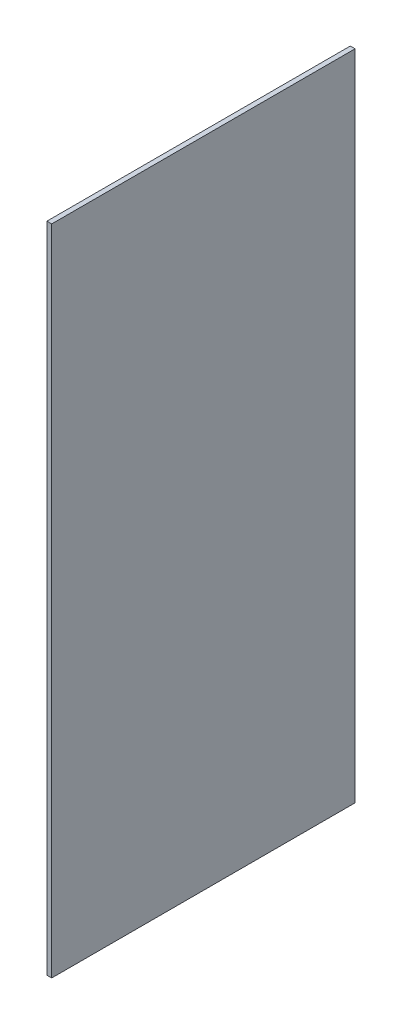
ISO-10303-21;
HEADER;
FILE_DESCRIPTION(('STEP AP214'),'2;1');
FILE_NAME('part.step','',(''),(''),'','','');
FILE_SCHEMA(('AUTOMOTIVE_DESIGN { 1 0 10303 214 1 1 1 1 }'));
ENDSEC;
DATA;
#1=APPLICATION_CONTEXT('core data for automotive mechanical design processes');
#2=APPLICATION_PROTOCOL_DEFINITION('international standard','automotive_design',2000,#1);
#3=PRODUCT_CONTEXT('',#1,'mechanical');
#4=PRODUCT('Part','Part','',(#3));
#5=PRODUCT_RELATED_PRODUCT_CATEGORY('part','',(#4));
#6=PRODUCT_DEFINITION_FORMATION('','',#4);
#7=PRODUCT_DEFINITION_CONTEXT('part definition',#1,'design');
#8=PRODUCT_DEFINITION('design','',#6,#7);
#9=PRODUCT_DEFINITION_SHAPE('','',#8);
#10=(LENGTH_UNIT() NAMED_UNIT(*) SI_UNIT(.MILLI.,.METRE.));
#11=(NAMED_UNIT(*) PLANE_ANGLE_UNIT() SI_UNIT($,.RADIAN.));
#12=(NAMED_UNIT(*) SI_UNIT($,.STERADIAN.) SOLID_ANGLE_UNIT());
#13=UNCERTAINTY_MEASURE_WITH_UNIT(LENGTH_MEASURE(1.E-05),#10,'distance_accuracy_value','');
#14=(GEOMETRIC_REPRESENTATION_CONTEXT(3) GLOBAL_UNCERTAINTY_ASSIGNED_CONTEXT((#13)) GLOBAL_UNIT_ASSIGNED_CONTEXT((#10,
#11,#12)) REPRESENTATION_CONTEXT('',''));
#15=CARTESIAN_POINT('',(0.,0.,0.));
#16=DIRECTION('',(0.,0.,1.));
#17=DIRECTION('',(1.,0.,0.));
#18=AXIS2_PLACEMENT_3D('',#15,#16,#17);
#19=CARTESIAN_POINT('',(-260.5,0.,-599.011002297004));
#20=DIRECTION('',(1.,0.,0.));
#21=DIRECTION('',(0.,0.,-1.));
#22=AXIS2_PLACEMENT_3D('',#19,#20,#21);
#23=PLANE('',#22);
#24=DIRECTION('',(0.,0.,1.));
#25=VECTOR('',#24,1.);
#26=CARTESIAN_POINT('',(-260.5,0.,-599.011002297004));
#27=LINE('',#26,#25);
#28=CARTESIAN_POINT('',(-260.5,0.,-190.));
#29=VERTEX_POINT('',#28);
#30=CARTESIAN_POINT('',(-260.5,0.,0.));
#31=VERTEX_POINT('',#30);
#32=EDGE_CURVE('E11',#29,#31,#27,.T.);
#33=ORIENTED_EDGE('',*,*,#32,.F.);
#34=DIRECTION('',(0.,1.,0.));
#35=VECTOR('',#34,1.);
#36=CARTESIAN_POINT('',(-260.5,0.,-190.));
#37=LINE('',#36,#35);
#38=CARTESIAN_POINT('',(-260.5,409.,-190.));
#39=VERTEX_POINT('',#38);
#40=EDGE_CURVE('E78',#29,#39,#37,.T.);
#41=ORIENTED_EDGE('',*,*,#40,.T.);
#42=DIRECTION('',(0.,0.,1.));
#43=VECTOR('',#42,1.);
#44=CARTESIAN_POINT('',(-260.5,409.,-599.011002297004));
#45=LINE('',#44,#43);
#46=CARTESIAN_POINT('',(-260.5,409.,0.));
#47=VERTEX_POINT('',#46);
#48=EDGE_CURVE('E39',#39,#47,#45,.T.);
#49=ORIENTED_EDGE('',*,*,#48,.T.);
#50=DIRECTION('',(0.,1.,0.));
#51=VECTOR('',#50,1.);
#52=CARTESIAN_POINT('',(-260.5,0.,0.));
#53=LINE('',#52,#51);
#54=EDGE_CURVE('E99',#31,#47,#53,.T.);
#55=ORIENTED_EDGE('',*,*,#54,.F.);
#56=EDGE_LOOP('',(#33,#41,#49,#55));
#57=FACE_BOUND('',#56,.T.);
#58=ADVANCED_FACE('F36',(#57),#23,.T.);
#59=CARTESIAN_POINT('',(-260.5,0.,-599.011002297004));
#60=DIRECTION('',(0.,1.,0.));
#61=DIRECTION('',(0.,0.,1.));
#62=AXIS2_PLACEMENT_3D('',#59,#60,#61);
#63=PLANE('',#62);
#64=DIRECTION('',(1.,0.,0.));
#65=VECTOR('',#64,1.);
#66=CARTESIAN_POINT('',(-260.5,0.,-190.));
#67=LINE('',#66,#65);
#68=CARTESIAN_POINT('',(-263.5,0.,-190.));
#69=VERTEX_POINT('',#68);
#70=EDGE_CURVE('E75',#29,#69,#67,.F.);
#71=ORIENTED_EDGE('',*,*,#70,.F.);
#72=ORIENTED_EDGE('',*,*,#32,.T.);
#73=DIRECTION('',(-1.,0.,0.));
#74=VECTOR('',#73,1.);
#75=CARTESIAN_POINT('',(-260.5,0.,0.));
#76=LINE('',#75,#74);
#77=CARTESIAN_POINT('',(-263.5,0.,0.));
#78=VERTEX_POINT('',#77);
#79=EDGE_CURVE('E89',#31,#78,#76,.T.);
#80=ORIENTED_EDGE('',*,*,#79,.T.);
#81=DIRECTION('',(0.,0.,1.));
#82=VECTOR('',#81,1.);
#83=CARTESIAN_POINT('',(-263.5,0.,-599.011002297004));
#84=LINE('',#83,#82);
#85=EDGE_CURVE('E44',#69,#78,#84,.T.);
#86=ORIENTED_EDGE('',*,*,#85,.F.);
#87=EDGE_LOOP('',(#71,#72,#80,#86));
#88=FACE_BOUND('',#87,.T.);
#89=ADVANCED_FACE('F88',(#88),#63,.F.);
#90=CARTESIAN_POINT('',(-263.5,0.,-599.011002297004));
#91=DIRECTION('',(1.,0.,0.));
#92=DIRECTION('',(0.,0.,-1.));
#93=AXIS2_PLACEMENT_3D('',#90,#91,#92);
#94=PLANE('',#93);
#95=DIRECTION('',(0.,1.,0.));
#96=VECTOR('',#95,1.);
#97=CARTESIAN_POINT('',(-263.5,0.,-190.));
#98=LINE('',#97,#96);
#99=CARTESIAN_POINT('',(-263.5,409.,-190.));
#100=VERTEX_POINT('',#99);
#101=EDGE_CURVE('E52',#69,#100,#98,.T.);
#102=ORIENTED_EDGE('',*,*,#101,.F.);
#103=ORIENTED_EDGE('',*,*,#85,.T.);
#104=DIRECTION('',(0.,1.,0.));
#105=VECTOR('',#104,1.);
#106=CARTESIAN_POINT('',(-263.5,0.,0.));
#107=LINE('',#106,#105);
#108=CARTESIAN_POINT('',(-263.5,409.,0.));
#109=VERTEX_POINT('',#108);
#110=EDGE_CURVE('E94',#78,#109,#107,.T.);
#111=ORIENTED_EDGE('',*,*,#110,.T.);
#112=DIRECTION('',(0.,0.,1.));
#113=VECTOR('',#112,1.);
#114=CARTESIAN_POINT('',(-263.5,409.,-599.011002297004));
#115=LINE('',#114,#113);
#116=EDGE_CURVE('E86',#100,#109,#115,.T.);
#117=ORIENTED_EDGE('',*,*,#116,.F.);
#118=EDGE_LOOP('',(#102,#103,#111,#117));
#119=FACE_BOUND('',#118,.T.);
#120=ADVANCED_FACE('F84',(#119),#94,.F.);
#121=CARTESIAN_POINT('',(-263.5,409.,-599.011002297004));
#122=DIRECTION('',(0.,-1.,0.));
#123=DIRECTION('',(0.,0.,-1.));
#124=AXIS2_PLACEMENT_3D('',#121,#122,#123);
#125=PLANE('',#124);
#126=DIRECTION('',(1.,0.,0.));
#127=VECTOR('',#126,1.);
#128=CARTESIAN_POINT('',(-260.5,409.,-190.));
#129=LINE('',#128,#127);
#130=EDGE_CURVE('E80',#39,#100,#129,.F.);
#131=ORIENTED_EDGE('',*,*,#130,.T.);
#132=ORIENTED_EDGE('',*,*,#116,.T.);
#133=DIRECTION('',(1.,0.,0.));
#134=VECTOR('',#133,1.);
#135=CARTESIAN_POINT('',(-263.5,409.,0.));
#136=LINE('',#135,#134);
#137=EDGE_CURVE('E96',#109,#47,#136,.T.);
#138=ORIENTED_EDGE('',*,*,#137,.T.);
#139=ORIENTED_EDGE('',*,*,#48,.F.);
#140=EDGE_LOOP('',(#131,#132,#138,#139));
#141=FACE_BOUND('',#140,.T.);
#142=ADVANCED_FACE('F107',(#141),#125,.F.);
#143=CARTESIAN_POINT('',(0.,0.,0.));
#144=DIRECTION('',(0.,0.,-1.));
#145=DIRECTION('',(-1.,0.,0.));
#146=AXIS2_PLACEMENT_3D('',#143,#144,#145);
#147=PLANE('',#146);
#148=ORIENTED_EDGE('',*,*,#54,.T.);
#149=ORIENTED_EDGE('',*,*,#137,.F.);
#150=ORIENTED_EDGE('',*,*,#110,.F.);
#151=ORIENTED_EDGE('',*,*,#79,.F.);
#152=EDGE_LOOP('',(#148,#149,#150,#151));
#153=FACE_BOUND('',#152,.T.);
#154=ADVANCED_FACE('F110',(#153),#147,.F.);
#155=CARTESIAN_POINT('',(-260.5,0.,-190.));
#156=DIRECTION('',(0.,0.,-1.));
#157=DIRECTION('',(0.,1.,0.));
#158=AXIS2_PLACEMENT_3D('',#155,#156,#157);
#159=PLANE('',#158);
#160=ORIENTED_EDGE('',*,*,#130,.F.);
#161=ORIENTED_EDGE('',*,*,#40,.F.);
#162=ORIENTED_EDGE('',*,*,#70,.T.);
#163=ORIENTED_EDGE('',*,*,#101,.T.);
#164=EDGE_LOOP('',(#160,#161,#162,#163));
#165=FACE_BOUND('',#164,.T.);
#166=ADVANCED_FACE('F76',(#165),#159,.T.);
#167=CLOSED_SHELL('',(#58,#89,#120,#142,#154,#166));
#168=MANIFOLD_SOLID_BREP('B2',#167);
#169=ADVANCED_BREP_SHAPE_REPRESENTATION('',(#18,#168),#14);
#170=SHAPE_DEFINITION_REPRESENTATION(#9,#169);
ENDSEC;
END-ISO-10303-21;
